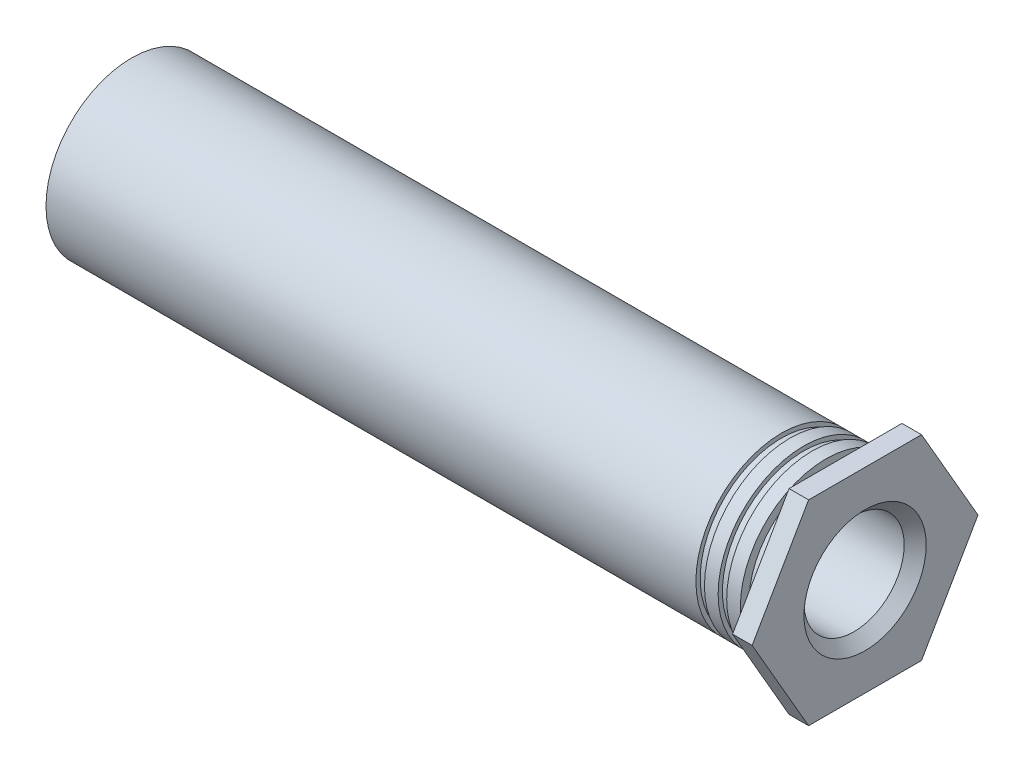
ISO-10303-21;
HEADER;
FILE_DESCRIPTION(('STEP AP214'),'2;1');
FILE_NAME('part.step','',(''),(''),'','','');
FILE_SCHEMA(('AUTOMOTIVE_DESIGN { 1 0 10303 214 1 1 1 1 }'));
ENDSEC;
DATA;
#1=APPLICATION_CONTEXT('core data for automotive mechanical design processes');
#2=APPLICATION_PROTOCOL_DEFINITION('international standard','automotive_design',2000,#1);
#3=PRODUCT_CONTEXT('',#1,'mechanical');
#4=PRODUCT('Part','Part','',(#3));
#5=PRODUCT_RELATED_PRODUCT_CATEGORY('part','',(#4));
#6=PRODUCT_DEFINITION_FORMATION('','',#4);
#7=PRODUCT_DEFINITION_CONTEXT('part definition',#1,'design');
#8=PRODUCT_DEFINITION('design','',#6,#7);
#9=PRODUCT_DEFINITION_SHAPE('','',#8);
#10=(LENGTH_UNIT() NAMED_UNIT(*) SI_UNIT(.MILLI.,.METRE.));
#11=(NAMED_UNIT(*) PLANE_ANGLE_UNIT() SI_UNIT($,.RADIAN.));
#12=(NAMED_UNIT(*) SI_UNIT($,.STERADIAN.) SOLID_ANGLE_UNIT());
#13=UNCERTAINTY_MEASURE_WITH_UNIT(LENGTH_MEASURE(1.E-05),#10,'distance_accuracy_value','');
#14=(GEOMETRIC_REPRESENTATION_CONTEXT(3) GLOBAL_UNCERTAINTY_ASSIGNED_CONTEXT((#13)) GLOBAL_UNIT_ASSIGNED_CONTEXT((#10,
#11,#12)) REPRESENTATION_CONTEXT('',''));
#15=CARTESIAN_POINT('',(0.,0.,0.));
#16=DIRECTION('',(0.,0.,1.));
#17=DIRECTION('',(1.,0.,0.));
#18=AXIS2_PLACEMENT_3D('',#15,#16,#17);
#19=CARTESIAN_POINT('',(-0.24,0.,0.));
#20=DIRECTION('',(1.,0.,0.));
#21=DIRECTION('',(0.,0.,-1.));
#22=AXIS2_PLACEMENT_3D('',#19,#20,#21);
#23=CYLINDRICAL_SURFACE('',#22,1.89);
#24=CARTESIAN_POINT('',(-0.48,0.,0.));
#25=DIRECTION('',(1.,0.,0.));
#26=DIRECTION('',(0.,0.,-1.));
#27=AXIS2_PLACEMENT_3D('',#24,#25,#26);
#28=CIRCLE('',#27,1.89);
#29=CARTESIAN_POINT('',(-0.479999999999999,0.,-1.89));
#30=VERTEX_POINT('',#29);
#31=EDGE_CURVE('E80',#30,#30,#28,.F.);
#32=ORIENTED_EDGE('',*,*,#31,.F.);
#33=EDGE_LOOP('',(#32));
#34=FACE_BOUND('',#33,.T.);
#35=CARTESIAN_POINT('',(0.,0.,0.));
#36=DIRECTION('',(1.,0.,0.));
#37=DIRECTION('',(0.,0.,-1.));
#38=AXIS2_PLACEMENT_3D('',#35,#36,#37);
#39=CIRCLE('',#38,1.89);
#40=CARTESIAN_POINT('',(0.,0.,-1.89));
#41=VERTEX_POINT('',#40);
#42=EDGE_CURVE('E19',#41,#41,#39,.F.);
#43=ORIENTED_EDGE('',*,*,#42,.T.);
#44=EDGE_LOOP('',(#43));
#45=FACE_BOUND('',#44,.T.);
#46=ADVANCED_FACE('F16',(#34,#45),#23,.T.);
#47=CARTESIAN_POINT('',(0.,0.,0.));
#48=DIRECTION('',(1.,0.,0.));
#49=DIRECTION('',(0.,1.,0.));
#50=AXIS2_PLACEMENT_3D('',#47,#48,#49);
#51=PLANE('',#50);
#52=ORIENTED_EDGE('',*,*,#42,.F.);
#53=EDGE_LOOP('',(#52));
#54=FACE_BOUND('',#53,.T.);
#55=DIRECTION('',(0.,0.,1.));
#56=VECTOR('',#55,1.);
#57=CARTESIAN_POINT('',(0.,2.4,1.3856406460551));
#58=LINE('',#57,#56);
#59=CARTESIAN_POINT('',(0.,2.4,-1.3856406460551));
#60=VERTEX_POINT('',#59);
#61=CARTESIAN_POINT('',(0.,2.4,1.3856406460551));
#62=VERTEX_POINT('',#61);
#63=EDGE_CURVE('E71',#60,#62,#58,.T.);
#64=ORIENTED_EDGE('',*,*,#63,.F.);
#65=DIRECTION('',(0.,0.866025403784439,0.5));
#66=VECTOR('',#65,1.);
#67=CARTESIAN_POINT('',(0.,2.4,-1.3856406460551));
#68=LINE('',#67,#66);
#69=CARTESIAN_POINT('',(0.,0.,-2.7712812921102));
#70=VERTEX_POINT('',#69);
#71=EDGE_CURVE('E436',#70,#60,#68,.T.);
#72=ORIENTED_EDGE('',*,*,#71,.F.);
#73=DIRECTION('',(0.,0.866025403784438,-0.5));
#74=VECTOR('',#73,1.);
#75=CARTESIAN_POINT('',(0.,0.,-2.7712812921102));
#76=LINE('',#75,#74);
#77=CARTESIAN_POINT('',(0.,-2.4,-1.3856406460551));
#78=VERTEX_POINT('',#77);
#79=EDGE_CURVE('E424',#78,#70,#76,.T.);
#80=ORIENTED_EDGE('',*,*,#79,.F.);
#81=DIRECTION('',(0.,0.,-1.));
#82=VECTOR('',#81,1.);
#83=CARTESIAN_POINT('',(0.,-2.4,-1.3856406460551));
#84=LINE('',#83,#82);
#85=CARTESIAN_POINT('',(0.,-2.4,1.3856406460551));
#86=VERTEX_POINT('',#85);
#87=EDGE_CURVE('E423',#86,#78,#84,.T.);
#88=ORIENTED_EDGE('',*,*,#87,.F.);
#89=DIRECTION('',(0.,-0.866025403784439,-0.5));
#90=VECTOR('',#89,1.);
#91=CARTESIAN_POINT('',(0.,-2.4,1.3856406460551));
#92=LINE('',#91,#90);
#93=CARTESIAN_POINT('',(0.,0.,2.7712812921102));
#94=VERTEX_POINT('',#93);
#95=EDGE_CURVE('E84',#94,#86,#92,.T.);
#96=ORIENTED_EDGE('',*,*,#95,.F.);
#97=DIRECTION('',(0.,-0.866025403784439,0.5));
#98=VECTOR('',#97,1.);
#99=CARTESIAN_POINT('',(0.,0.,2.7712812921102));
#100=LINE('',#99,#98);
#101=EDGE_CURVE('E66',#62,#94,#100,.T.);
#102=ORIENTED_EDGE('',*,*,#101,.F.);
#103=EDGE_LOOP('',(#64,#72,#80,#88,#96,#102));
#104=FACE_BOUND('',#103,.T.);
#105=ADVANCED_FACE('F82',(#54,#104),#51,.F.);
#106=CARTESIAN_POINT('',(-0.48,0.,1.05));
#107=DIRECTION('',(1.,0.,0.));
#108=DIRECTION('',(0.,0.,-1.));
#109=AXIS2_PLACEMENT_3D('',#106,#107,#108);
#110=PLANE('',#109);
#111=CARTESIAN_POINT('',(-0.48,0.,0.));
#112=DIRECTION('',(1.,0.,0.));
#113=DIRECTION('',(0.,0.,-1.));
#114=AXIS2_PLACEMENT_3D('',#111,#112,#113);
#115=CIRCLE('',#114,2.1);
#116=CARTESIAN_POINT('',(-0.479999999999999,0.,-2.1));
#117=VERTEX_POINT('',#116);
#118=EDGE_CURVE('E133',#117,#117,#115,.F.);
#119=ORIENTED_EDGE('',*,*,#118,.F.);
#120=EDGE_LOOP('',(#119));
#121=FACE_BOUND('',#120,.T.);
#122=ORIENTED_EDGE('',*,*,#31,.T.);
#123=EDGE_LOOP('',(#122));
#124=FACE_BOUND('',#123,.T.);
#125=ADVANCED_FACE('F144',(#121,#124),#110,.T.);
#126=CARTESIAN_POINT('',(0.,2.4,1.3856406460551));
#127=DIRECTION('',(0.,1.,0.));
#128=DIRECTION('',(0.,0.,1.));
#129=AXIS2_PLACEMENT_3D('',#126,#127,#128);
#130=PLANE('',#129);
#131=ORIENTED_EDGE('',*,*,#63,.T.);
#132=DIRECTION('',(1.,0.,0.));
#133=VECTOR('',#132,1.);
#134=CARTESIAN_POINT('',(0.,2.4,1.3856406460551));
#135=LINE('',#134,#133);
#136=CARTESIAN_POINT('',(0.48,2.4,1.3856406460551));
#137=VERTEX_POINT('',#136);
#138=EDGE_CURVE('E73',#137,#62,#135,.F.);
#139=ORIENTED_EDGE('',*,*,#138,.F.);
#140=DIRECTION('',(0.,0.,1.));
#141=VECTOR('',#140,1.);
#142=CARTESIAN_POINT('',(0.48,2.4,0.));
#143=LINE('',#142,#141);
#144=CARTESIAN_POINT('',(0.48,2.4,-1.3856406460551));
#145=VERTEX_POINT('',#144);
#146=EDGE_CURVE('E135',#145,#137,#143,.T.);
#147=ORIENTED_EDGE('',*,*,#146,.F.);
#148=DIRECTION('',(1.,0.,0.));
#149=VECTOR('',#148,1.);
#150=CARTESIAN_POINT('',(0.,2.4,-1.3856406460551));
#151=LINE('',#150,#149);
#152=EDGE_CURVE('E76',#60,#145,#151,.T.);
#153=ORIENTED_EDGE('',*,*,#152,.F.);
#154=EDGE_LOOP('',(#131,#139,#147,#153));
#155=FACE_BOUND('',#154,.T.);
#156=ADVANCED_FACE('F72',(#155),#130,.T.);
#157=CARTESIAN_POINT('',(0.,0.,2.7712812921102));
#158=DIRECTION('',(0.,0.5,0.866025403784439));
#159=DIRECTION('',(0.,-0.866025403784439,0.5));
#160=AXIS2_PLACEMENT_3D('',#157,#158,#159);
#161=PLANE('',#160);
#162=ORIENTED_EDGE('',*,*,#101,.T.);
#163=DIRECTION('',(1.,0.,0.));
#164=VECTOR('',#163,1.);
#165=CARTESIAN_POINT('',(0.,0.,2.7712812921102));
#166=LINE('',#165,#164);
#167=CARTESIAN_POINT('',(0.48,0.,2.7712812921102));
#168=VERTEX_POINT('',#167);
#169=EDGE_CURVE('E86',#168,#94,#166,.F.);
#170=ORIENTED_EDGE('',*,*,#169,.F.);
#171=DIRECTION('',(0.,-0.866025403784439,0.5));
#172=VECTOR('',#171,1.);
#173=CARTESIAN_POINT('',(0.48,2.4,1.3856406460551));
#174=LINE('',#173,#172);
#175=EDGE_CURVE('E90',#137,#168,#174,.T.);
#176=ORIENTED_EDGE('',*,*,#175,.F.);
#177=ORIENTED_EDGE('',*,*,#138,.T.);
#178=EDGE_LOOP('',(#162,#170,#176,#177));
#179=FACE_BOUND('',#178,.T.);
#180=ADVANCED_FACE('F88',(#179),#161,.T.);
#181=CARTESIAN_POINT('',(0.,-2.4,1.3856406460551));
#182=DIRECTION('',(0.,-0.5,0.866025403784439));
#183=DIRECTION('',(0.,-0.866025403784439,-0.5));
#184=AXIS2_PLACEMENT_3D('',#181,#182,#183);
#185=PLANE('',#184);
#186=ORIENTED_EDGE('',*,*,#95,.T.);
#187=DIRECTION('',(1.,0.,0.));
#188=VECTOR('',#187,1.);
#189=CARTESIAN_POINT('',(0.,-2.4,1.3856406460551));
#190=LINE('',#189,#188);
#191=CARTESIAN_POINT('',(0.48,-2.4,1.3856406460551));
#192=VERTEX_POINT('',#191);
#193=EDGE_CURVE('E419',#192,#86,#190,.F.);
#194=ORIENTED_EDGE('',*,*,#193,.F.);
#195=DIRECTION('',(0.,-0.866025403784439,-0.5));
#196=VECTOR('',#195,1.);
#197=CARTESIAN_POINT('',(0.48,0.,2.7712812921102));
#198=LINE('',#197,#196);
#199=EDGE_CURVE('E441',#168,#192,#198,.T.);
#200=ORIENTED_EDGE('',*,*,#199,.F.);
#201=ORIENTED_EDGE('',*,*,#169,.T.);
#202=EDGE_LOOP('',(#186,#194,#200,#201));
#203=FACE_BOUND('',#202,.T.);
#204=ADVANCED_FACE('F231',(#203),#185,.T.);
#205=CARTESIAN_POINT('',(0.,-2.4,-1.3856406460551));
#206=DIRECTION('',(0.,-1.,0.));
#207=DIRECTION('',(0.,0.,-1.));
#208=AXIS2_PLACEMENT_3D('',#205,#206,#207);
#209=PLANE('',#208);
#210=ORIENTED_EDGE('',*,*,#87,.T.);
#211=DIRECTION('',(1.,0.,0.));
#212=VECTOR('',#211,1.);
#213=CARTESIAN_POINT('',(0.,-2.4,-1.3856406460551));
#214=LINE('',#213,#212);
#215=CARTESIAN_POINT('',(0.48,-2.4,-1.3856406460551));
#216=VERTEX_POINT('',#215);
#217=EDGE_CURVE('E426',#216,#78,#214,.F.);
#218=ORIENTED_EDGE('',*,*,#217,.F.);
#219=DIRECTION('',(0.,0.,1.));
#220=VECTOR('',#219,1.);
#221=CARTESIAN_POINT('',(0.48,-2.4,0.));
#222=LINE('',#221,#220);
#223=EDGE_CURVE('E429',#192,#216,#222,.F.);
#224=ORIENTED_EDGE('',*,*,#223,.F.);
#225=ORIENTED_EDGE('',*,*,#193,.T.);
#226=EDGE_LOOP('',(#210,#218,#224,#225));
#227=FACE_BOUND('',#226,.T.);
#228=ADVANCED_FACE('F228',(#227),#209,.T.);
#229=CARTESIAN_POINT('',(0.,0.,-2.7712812921102));
#230=DIRECTION('',(0.,-0.5,-0.866025403784438));
#231=DIRECTION('',(0.,0.866025403784438,-0.5));
#232=AXIS2_PLACEMENT_3D('',#229,#230,#231);
#233=PLANE('',#232);
#234=ORIENTED_EDGE('',*,*,#79,.T.);
#235=DIRECTION('',(1.,0.,0.));
#236=VECTOR('',#235,1.);
#237=CARTESIAN_POINT('',(0.,0.,-2.7712812921102));
#238=LINE('',#237,#236);
#239=CARTESIAN_POINT('',(0.48,0.,-2.7712812921102));
#240=VERTEX_POINT('',#239);
#241=EDGE_CURVE('E34',#240,#70,#238,.F.);
#242=ORIENTED_EDGE('',*,*,#241,.F.);
#243=DIRECTION('',(0.,0.866025403784439,-0.5));
#244=VECTOR('',#243,1.);
#245=CARTESIAN_POINT('',(0.48,-2.4,-1.3856406460551));
#246=LINE('',#245,#244);
#247=EDGE_CURVE('E444',#216,#240,#246,.T.);
#248=ORIENTED_EDGE('',*,*,#247,.F.);
#249=ORIENTED_EDGE('',*,*,#217,.T.);
#250=EDGE_LOOP('',(#234,#242,#248,#249));
#251=FACE_BOUND('',#250,.T.);
#252=ADVANCED_FACE('F224',(#251),#233,.T.);
#253=CARTESIAN_POINT('',(0.,2.4,-1.3856406460551));
#254=DIRECTION('',(0.,0.5,-0.866025403784439));
#255=DIRECTION('',(0.,0.866025403784439,0.5));
#256=AXIS2_PLACEMENT_3D('',#253,#254,#255);
#257=PLANE('',#256);
#258=ORIENTED_EDGE('',*,*,#71,.T.);
#259=ORIENTED_EDGE('',*,*,#152,.T.);
#260=DIRECTION('',(0.,0.866025403784439,0.499999999999999));
#261=VECTOR('',#260,1.);
#262=CARTESIAN_POINT('',(0.48,0.,-2.7712812921102));
#263=LINE('',#262,#261);
#264=EDGE_CURVE('E132',#240,#145,#263,.T.);
#265=ORIENTED_EDGE('',*,*,#264,.F.);
#266=ORIENTED_EDGE('',*,*,#241,.T.);
#267=EDGE_LOOP('',(#258,#259,#265,#266));
#268=FACE_BOUND('',#267,.T.);
#269=ADVANCED_FACE('F220',(#268),#257,.T.);
#270=CARTESIAN_POINT('',(-9.,0.,0.));
#271=DIRECTION('',(1.,0.,0.));
#272=DIRECTION('',(0.,0.,-1.));
#273=AXIS2_PLACEMENT_3D('',#270,#271,#272);
#274=CYLINDRICAL_SURFACE('',#273,2.1);
#275=CARTESIAN_POINT('',(-0.816000000000001,0.,0.));
#276=DIRECTION('',(1.,0.,0.));
#277=DIRECTION('',(0.,0.,-1.));
#278=AXIS2_PLACEMENT_3D('',#275,#276,#277);
#279=CIRCLE('',#278,2.1);
#280=CARTESIAN_POINT('',(-0.816,0.,-2.1));
#281=VERTEX_POINT('',#280);
#282=EDGE_CURVE('E129',#281,#281,#279,.T.);
#283=ORIENTED_EDGE('',*,*,#282,.T.);
#284=EDGE_LOOP('',(#283));
#285=FACE_BOUND('',#284,.T.);
#286=ORIENTED_EDGE('',*,*,#118,.T.);
#287=EDGE_LOOP('',(#286));
#288=FACE_BOUND('',#287,.T.);
#289=ADVANCED_FACE('F216',(#285,#288),#274,.T.);
#290=CARTESIAN_POINT('',(0.48,0.,0.));
#291=DIRECTION('',(1.,0.,0.));
#292=DIRECTION('',(0.,1.,0.));
#293=AXIS2_PLACEMENT_3D('',#290,#291,#292);
#294=PLANE('',#293);
#295=ORIENTED_EDGE('',*,*,#247,.T.);
#296=ORIENTED_EDGE('',*,*,#264,.T.);
#297=ORIENTED_EDGE('',*,*,#146,.T.);
#298=ORIENTED_EDGE('',*,*,#175,.T.);
#299=ORIENTED_EDGE('',*,*,#199,.T.);
#300=ORIENTED_EDGE('',*,*,#223,.T.);
#301=EDGE_LOOP('',(#295,#296,#297,#298,#299,#300));
#302=FACE_BOUND('',#301,.T.);
#303=CARTESIAN_POINT('',(0.479999999981828,0.,0.));
#304=DIRECTION('',(1.,0.,0.));
#305=DIRECTION('',(0.,0.,-1.));
#306=AXIS2_PLACEMENT_3D('',#303,#304,#305);
#307=CIRCLE('',#306,1.49999999996453);
#308=CARTESIAN_POINT('',(0.479999999981828,0.,-1.49999999996453));
#309=VERTEX_POINT('',#308);
#310=EDGE_CURVE('E126',#309,#309,#307,.F.);
#311=ORIENTED_EDGE('',*,*,#310,.T.);
#312=EDGE_LOOP('',(#311));
#313=FACE_BOUND('',#312,.T.);
#314=ADVANCED_FACE('F212',(#302,#313),#294,.T.);
#315=CARTESIAN_POINT('',(-0.816000000000001,0.,2.0475));
#316=DIRECTION('',(1.,0.,0.));
#317=DIRECTION('',(0.,0.,-1.));
#318=AXIS2_PLACEMENT_3D('',#315,#316,#317);
#319=PLANE('',#318);
#320=ORIENTED_EDGE('',*,*,#282,.F.);
#321=EDGE_LOOP('',(#320));
#322=FACE_BOUND('',#321,.T.);
#323=CARTESIAN_POINT('',(-0.816,0.,0.));
#324=DIRECTION('',(1.,0.,0.));
#325=DIRECTION('',(0.,0.,-1.));
#326=AXIS2_PLACEMENT_3D('',#323,#324,#325);
#327=CIRCLE('',#326,1.995);
#328=CARTESIAN_POINT('',(-0.816,0.,-1.995));
#329=VERTEX_POINT('',#328);
#330=EDGE_CURVE('E123',#329,#329,#327,.F.);
#331=ORIENTED_EDGE('',*,*,#330,.F.);
#332=EDGE_LOOP('',(#331));
#333=FACE_BOUND('',#332,.T.);
#334=ADVANCED_FACE('F208',(#322,#333),#319,.F.);
#335=CARTESIAN_POINT('',(0.479999999981828,0.,0.));
#336=DIRECTION('',(1.,0.,0.));
#337=DIRECTION('',(0.,0.,-1.));
#338=AXIS2_PLACEMENT_3D('',#335,#336,#337);
#339=CONICAL_SURFACE('',#338,1.49999999996453,0.785398163397448);
#340=CARTESIAN_POINT('',(0.2095,0.,0.));
#341=DIRECTION('',(1.,0.,0.));
#342=DIRECTION('',(0.,0.,-1.));
#343=AXIS2_PLACEMENT_3D('',#340,#341,#342);
#344=CIRCLE('',#343,1.2295);
#345=CARTESIAN_POINT('',(0.2095,0.,-1.2295));
#346=VERTEX_POINT('',#345);
#347=EDGE_CURVE('E122',#346,#346,#344,.F.);
#348=ORIENTED_EDGE('',*,*,#347,.T.);
#349=EDGE_LOOP('',(#348));
#350=FACE_BOUND('',#349,.T.);
#351=ORIENTED_EDGE('',*,*,#310,.F.);
#352=EDGE_LOOP('',(#351));
#353=FACE_BOUND('',#352,.T.);
#354=ADVANCED_FACE('F204',(#350,#353),#339,.F.);
#355=CARTESIAN_POINT('',(-0.921,0.,0.));
#356=DIRECTION('',(1.,0.,0.));
#357=DIRECTION('',(0.,0.,-1.));
#358=AXIS2_PLACEMENT_3D('',#355,#356,#357);
#359=CYLINDRICAL_SURFACE('',#358,1.995);
#360=CARTESIAN_POINT('',(-1.026,0.,0.));
#361=DIRECTION('',(1.,0.,0.));
#362=DIRECTION('',(0.,0.,-1.));
#363=AXIS2_PLACEMENT_3D('',#360,#361,#362);
#364=CIRCLE('',#363,1.995);
#365=CARTESIAN_POINT('',(-1.026,0.,-1.995));
#366=VERTEX_POINT('',#365);
#367=EDGE_CURVE('E119',#366,#366,#364,.T.);
#368=ORIENTED_EDGE('',*,*,#367,.T.);
#369=EDGE_LOOP('',(#368));
#370=FACE_BOUND('',#369,.T.);
#371=ORIENTED_EDGE('',*,*,#330,.T.);
#372=EDGE_LOOP('',(#371));
#373=FACE_BOUND('',#372,.T.);
#374=ADVANCED_FACE('F200',(#370,#373),#359,.T.);
#375=CARTESIAN_POINT('',(-4.52,0.,0.));
#376=DIRECTION('',(1.,0.,0.));
#377=DIRECTION('',(0.,0.,-1.));
#378=AXIS2_PLACEMENT_3D('',#375,#376,#377);
#379=CYLINDRICAL_SURFACE('',#378,1.2295);
#380=CARTESIAN_POINT('',(-9.24949999995306,0.,0.));
#381=DIRECTION('',(-1.,0.,0.));
#382=DIRECTION('',(0.,0.,-1.));
#383=AXIS2_PLACEMENT_3D('',#380,#381,#382);
#384=CIRCLE('',#383,1.2295000000222);
#385=CARTESIAN_POINT('',(-9.24949999995306,0.,-1.2295000000222));
#386=VERTEX_POINT('',#385);
#387=EDGE_CURVE('E118',#386,#386,#384,.T.);
#388=ORIENTED_EDGE('',*,*,#387,.T.);
#389=EDGE_LOOP('',(#388));
#390=FACE_BOUND('',#389,.T.);
#391=ORIENTED_EDGE('',*,*,#347,.F.);
#392=EDGE_LOOP('',(#391));
#393=FACE_BOUND('',#392,.T.);
#394=ADVANCED_FACE('F196',(#390,#393),#379,.F.);
#395=CARTESIAN_POINT('',(-1.026,0.,2.0475));
#396=DIRECTION('',(-1.,0.,0.));
#397=DIRECTION('',(0.,0.,1.));
#398=AXIS2_PLACEMENT_3D('',#395,#396,#397);
#399=PLANE('',#398);
#400=ORIENTED_EDGE('',*,*,#367,.F.);
#401=EDGE_LOOP('',(#400));
#402=FACE_BOUND('',#401,.T.);
#403=CARTESIAN_POINT('',(-1.026,0.,0.));
#404=DIRECTION('',(1.,0.,0.));
#405=DIRECTION('',(0.,0.,-1.));
#406=AXIS2_PLACEMENT_3D('',#403,#404,#405);
#407=CIRCLE('',#406,2.1);
#408=CARTESIAN_POINT('',(-1.026,0.,-2.1));
#409=VERTEX_POINT('',#408);
#410=EDGE_CURVE('E115',#409,#409,#407,.F.);
#411=ORIENTED_EDGE('',*,*,#410,.F.);
#412=EDGE_LOOP('',(#411));
#413=FACE_BOUND('',#412,.T.);
#414=ADVANCED_FACE('F192',(#402,#413),#399,.F.);
#415=CARTESIAN_POINT('',(-9.52000000000908,0.,0.));
#416=DIRECTION('',(-1.,0.,0.));
#417=DIRECTION('',(0.,0.,1.));
#418=AXIS2_PLACEMENT_3D('',#415,#416,#417);
#419=CONICAL_SURFACE('',#418,1.50000000002137,0.785398163397448);
#420=CARTESIAN_POINT('',(-9.52000000000908,0.,0.));
#421=DIRECTION('',(-1.,0.,0.));
#422=DIRECTION('',(0.,0.,1.));
#423=AXIS2_PLACEMENT_3D('',#420,#421,#422);
#424=CIRCLE('',#423,1.50000000002137);
#425=CARTESIAN_POINT('',(-9.52000000000908,0.,1.50000000002137));
#426=VERTEX_POINT('',#425);
#427=EDGE_CURVE('E112',#426,#426,#424,.T.);
#428=ORIENTED_EDGE('',*,*,#427,.T.);
#429=EDGE_LOOP('',(#428));
#430=FACE_BOUND('',#429,.T.);
#431=ORIENTED_EDGE('',*,*,#387,.F.);
#432=EDGE_LOOP('',(#431));
#433=FACE_BOUND('',#432,.T.);
#434=ADVANCED_FACE('F188',(#430,#433),#419,.F.);
#435=CARTESIAN_POINT('',(-9.,0.,0.));
#436=DIRECTION('',(1.,0.,0.));
#437=DIRECTION('',(0.,0.,-1.));
#438=AXIS2_PLACEMENT_3D('',#435,#436,#437);
#439=CYLINDRICAL_SURFACE('',#438,2.1);
#440=CARTESIAN_POINT('',(-1.362,0.,0.));
#441=DIRECTION('',(1.,0.,0.));
#442=DIRECTION('',(0.,0.,-1.));
#443=AXIS2_PLACEMENT_3D('',#440,#441,#442);
#444=CIRCLE('',#443,2.1);
#445=CARTESIAN_POINT('',(-1.362,0.,-2.1));
#446=VERTEX_POINT('',#445);
#447=EDGE_CURVE('E109',#446,#446,#444,.T.);
#448=ORIENTED_EDGE('',*,*,#447,.T.);
#449=EDGE_LOOP('',(#448));
#450=FACE_BOUND('',#449,.T.);
#451=ORIENTED_EDGE('',*,*,#410,.T.);
#452=EDGE_LOOP('',(#451));
#453=FACE_BOUND('',#452,.T.);
#454=ADVANCED_FACE('F184',(#450,#453),#439,.T.);
#455=CARTESIAN_POINT('',(-9.52,0.,-0.8));
#456=DIRECTION('',(1.,0.,0.));
#457=DIRECTION('',(0.,0.,-1.));
#458=AXIS2_PLACEMENT_3D('',#455,#456,#457);
#459=PLANE('',#458);
#460=CARTESIAN_POINT('',(-9.52,0.,0.));
#461=DIRECTION('',(-1.,0.,0.));
#462=DIRECTION('',(0.,0.,1.));
#463=AXIS2_PLACEMENT_3D('',#460,#461,#462);
#464=CIRCLE('',#463,1.6);
#465=CARTESIAN_POINT('',(-9.52,0.,1.6));
#466=VERTEX_POINT('',#465);
#467=EDGE_CURVE('E106',#466,#466,#464,.T.);
#468=ORIENTED_EDGE('',*,*,#467,.T.);
#469=EDGE_LOOP('',(#468));
#470=FACE_BOUND('',#469,.T.);
#471=ORIENTED_EDGE('',*,*,#427,.F.);
#472=EDGE_LOOP('',(#471));
#473=FACE_BOUND('',#472,.T.);
#474=ADVANCED_FACE('F180',(#470,#473),#459,.F.);
#475=CARTESIAN_POINT('',(-1.362,0.,2.0475));
#476=DIRECTION('',(1.,0.,0.));
#477=DIRECTION('',(0.,0.,-1.));
#478=AXIS2_PLACEMENT_3D('',#475,#476,#477);
#479=PLANE('',#478);
#480=ORIENTED_EDGE('',*,*,#447,.F.);
#481=EDGE_LOOP('',(#480));
#482=FACE_BOUND('',#481,.T.);
#483=CARTESIAN_POINT('',(-1.362,0.,0.));
#484=DIRECTION('',(1.,0.,0.));
#485=DIRECTION('',(0.,0.,-1.));
#486=AXIS2_PLACEMENT_3D('',#483,#484,#485);
#487=CIRCLE('',#486,1.995);
#488=CARTESIAN_POINT('',(-1.362,0.,-1.995));
#489=VERTEX_POINT('',#488);
#490=EDGE_CURVE('E103',#489,#489,#487,.F.);
#491=ORIENTED_EDGE('',*,*,#490,.F.);
#492=EDGE_LOOP('',(#491));
#493=FACE_BOUND('',#492,.T.);
#494=ADVANCED_FACE('F176',(#482,#493),#479,.F.);
#495=CARTESIAN_POINT('',(-13.52,0.,0.));
#496=DIRECTION('',(-1.,0.,0.));
#497=DIRECTION('',(0.,0.,1.));
#498=AXIS2_PLACEMENT_3D('',#495,#496,#497);
#499=CYLINDRICAL_SURFACE('',#498,1.6);
#500=CARTESIAN_POINT('',(-17.52,0.,0.));
#501=DIRECTION('',(-1.,0.,0.));
#502=DIRECTION('',(0.,0.,1.));
#503=AXIS2_PLACEMENT_3D('',#500,#501,#502);
#504=CIRCLE('',#503,1.6);
#505=CARTESIAN_POINT('',(-17.52,0.,1.6));
#506=VERTEX_POINT('',#505);
#507=EDGE_CURVE('E100',#506,#506,#504,.F.);
#508=ORIENTED_EDGE('',*,*,#507,.F.);
#509=EDGE_LOOP('',(#508));
#510=FACE_BOUND('',#509,.T.);
#511=ORIENTED_EDGE('',*,*,#467,.F.);
#512=EDGE_LOOP('',(#511));
#513=FACE_BOUND('',#512,.T.);
#514=ADVANCED_FACE('F172',(#510,#513),#499,.F.);
#515=CARTESIAN_POINT('',(-1.467,0.,0.));
#516=DIRECTION('',(1.,0.,0.));
#517=DIRECTION('',(0.,0.,-1.));
#518=AXIS2_PLACEMENT_3D('',#515,#516,#517);
#519=CYLINDRICAL_SURFACE('',#518,1.995);
#520=CARTESIAN_POINT('',(-1.572,0.,0.));
#521=DIRECTION('',(1.,0.,0.));
#522=DIRECTION('',(0.,0.,-1.));
#523=AXIS2_PLACEMENT_3D('',#520,#521,#522);
#524=CIRCLE('',#523,1.995);
#525=CARTESIAN_POINT('',(-1.572,0.,-1.995));
#526=VERTEX_POINT('',#525);
#527=EDGE_CURVE('E97',#526,#526,#524,.T.);
#528=ORIENTED_EDGE('',*,*,#527,.T.);
#529=EDGE_LOOP('',(#528));
#530=FACE_BOUND('',#529,.T.);
#531=ORIENTED_EDGE('',*,*,#490,.T.);
#532=EDGE_LOOP('',(#531));
#533=FACE_BOUND('',#532,.T.);
#534=ADVANCED_FACE('F168',(#530,#533),#519,.T.);
#535=CARTESIAN_POINT('',(-17.52,0.,1.05));
#536=DIRECTION('',(-1.,0.,0.));
#537=DIRECTION('',(0.,0.,1.));
#538=AXIS2_PLACEMENT_3D('',#535,#536,#537);
#539=PLANE('',#538);
#540=CARTESIAN_POINT('',(-17.52,0.,0.));
#541=DIRECTION('',(1.,0.,0.));
#542=DIRECTION('',(0.,0.,-1.));
#543=AXIS2_PLACEMENT_3D('',#540,#541,#542);
#544=CIRCLE('',#543,2.1);
#545=CARTESIAN_POINT('',(-17.52,0.,-2.1));
#546=VERTEX_POINT('',#545);
#547=EDGE_CURVE('E25',#546,#546,#544,.T.);
#548=ORIENTED_EDGE('',*,*,#547,.F.);
#549=EDGE_LOOP('',(#548));
#550=FACE_BOUND('',#549,.T.);
#551=ORIENTED_EDGE('',*,*,#507,.T.);
#552=EDGE_LOOP('',(#551));
#553=FACE_BOUND('',#552,.T.);
#554=ADVANCED_FACE('F161',(#550,#553),#539,.T.);
#555=CARTESIAN_POINT('',(-1.572,0.,2.0475));
#556=DIRECTION('',(-1.,0.,0.));
#557=DIRECTION('',(0.,0.,1.));
#558=AXIS2_PLACEMENT_3D('',#555,#556,#557);
#559=PLANE('',#558);
#560=ORIENTED_EDGE('',*,*,#527,.F.);
#561=EDGE_LOOP('',(#560));
#562=FACE_BOUND('',#561,.T.);
#563=CARTESIAN_POINT('',(-1.572,0.,0.));
#564=DIRECTION('',(1.,0.,0.));
#565=DIRECTION('',(0.,0.,-1.));
#566=AXIS2_PLACEMENT_3D('',#563,#564,#565);
#567=CIRCLE('',#566,2.1);
#568=CARTESIAN_POINT('',(-1.572,0.,-2.1));
#569=VERTEX_POINT('',#568);
#570=EDGE_CURVE('E10',#569,#569,#567,.F.);
#571=ORIENTED_EDGE('',*,*,#570,.F.);
#572=EDGE_LOOP('',(#571));
#573=FACE_BOUND('',#572,.T.);
#574=ADVANCED_FACE('F155',(#562,#573),#559,.F.);
#575=CARTESIAN_POINT('',(-9.,0.,0.));
#576=DIRECTION('',(1.,0.,0.));
#577=DIRECTION('',(0.,0.,-1.));
#578=AXIS2_PLACEMENT_3D('',#575,#576,#577);
#579=CYLINDRICAL_SURFACE('',#578,2.1);
#580=ORIENTED_EDGE('',*,*,#547,.T.);
#581=EDGE_LOOP('',(#580));
#582=FACE_BOUND('',#581,.T.);
#583=ORIENTED_EDGE('',*,*,#570,.T.);
#584=EDGE_LOOP('',(#583));
#585=FACE_BOUND('',#584,.T.);
#586=ADVANCED_FACE('F153',(#582,#585),#579,.T.);
#587=CLOSED_SHELL('',(#46,#105,#125,#156,#180,#204,#228,#252,#269,#289,#314,#334,#354,#374,#394,
#414,#434,#454,#474,#494,#514,#534,#554,#574,#586));
#588=MANIFOLD_SOLID_BREP('B1',#587);
#589=ADVANCED_BREP_SHAPE_REPRESENTATION('',(#18,#588),#14);
#590=SHAPE_DEFINITION_REPRESENTATION(#9,#589);
ENDSEC;
END-ISO-10303-21;
